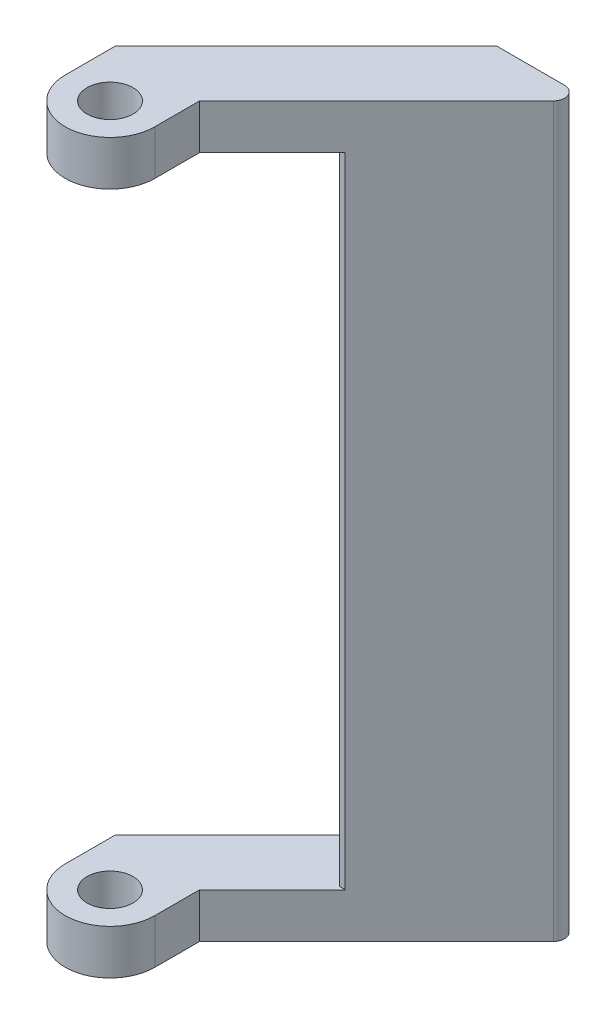
ISO-10303-21;
HEADER;
FILE_DESCRIPTION(('STEP AP214'),'2;1');
FILE_NAME('part.step','',(''),(''),'','','');
FILE_SCHEMA(('AUTOMOTIVE_DESIGN { 1 0 10303 214 1 1 1 1 }'));
ENDSEC;
DATA;
#1=APPLICATION_CONTEXT('core data for automotive mechanical design processes');
#2=APPLICATION_PROTOCOL_DEFINITION('international standard','automotive_design',2000,#1);
#3=PRODUCT_CONTEXT('',#1,'mechanical');
#4=PRODUCT('Part','Part','',(#3));
#5=PRODUCT_RELATED_PRODUCT_CATEGORY('part','',(#4));
#6=PRODUCT_DEFINITION_FORMATION('','',#4);
#7=PRODUCT_DEFINITION_CONTEXT('part definition',#1,'design');
#8=PRODUCT_DEFINITION('design','',#6,#7);
#9=PRODUCT_DEFINITION_SHAPE('','',#8);
#10=(LENGTH_UNIT() NAMED_UNIT(*) SI_UNIT(.MILLI.,.METRE.));
#11=(NAMED_UNIT(*) PLANE_ANGLE_UNIT() SI_UNIT($,.RADIAN.));
#12=(NAMED_UNIT(*) SI_UNIT($,.STERADIAN.) SOLID_ANGLE_UNIT());
#13=UNCERTAINTY_MEASURE_WITH_UNIT(LENGTH_MEASURE(1.E-05),#10,'distance_accuracy_value','');
#14=(GEOMETRIC_REPRESENTATION_CONTEXT(3) GLOBAL_UNCERTAINTY_ASSIGNED_CONTEXT((#13)) GLOBAL_UNIT_ASSIGNED_CONTEXT((#10,
#11,#12)) REPRESENTATION_CONTEXT('',''));
#15=CARTESIAN_POINT('',(0.,0.,0.));
#16=DIRECTION('',(0.,0.,1.));
#17=DIRECTION('',(1.,0.,0.));
#18=AXIS2_PLACEMENT_3D('',#15,#16,#17);
#19=CARTESIAN_POINT('',(-2.41421356205465,-57.59999997,0.999999999868094));
#20=DIRECTION('',(0.,-1.,0.));
#21=DIRECTION('',(0.,0.,-1.));
#22=AXIS2_PLACEMENT_3D('',#19,#20,#21);
#23=PLANE('',#22);
#24=CARTESIAN_POINT('',(-21.5,-57.59999997,21.5));
#25=DIRECTION('',(0.,-1.,0.));
#26=DIRECTION('',(0.,0.,-1.));
#27=AXIS2_PLACEMENT_3D('',#24,#25,#26);
#28=CIRCLE('',#27,2.04999999999999);
#29=CARTESIAN_POINT('',(-21.5,-57.59999997,19.45));
#30=VERTEX_POINT('',#29);
#31=EDGE_CURVE('E227',#30,#30,#28,.T.);
#32=ORIENTED_EDGE('',*,*,#31,.T.);
#33=EDGE_LOOP('',(#32));
#34=FACE_BOUND('',#33,.T.);
#35=DIRECTION('',(1.,0.,0.));
#36=VECTOR('',#35,1.);
#37=CARTESIAN_POINT('',(-11.0000000026681,-57.59999997,11.0000000026681));
#38=LINE('',#37,#36);
#39=CARTESIAN_POINT('',(-11.5000000024369,-57.59999997,11.0000000026681));
#40=VERTEX_POINT('',#39);
#41=CARTESIAN_POINT('',(-11.0000000026681,-57.59999997,11.0000000026681));
#42=VERTEX_POINT('',#41);
#43=EDGE_CURVE('E165',#40,#42,#38,.T.);
#44=ORIENTED_EDGE('',*,*,#43,.F.);
#45=DIRECTION('',(0.,0.,1.));
#46=VECTOR('',#45,1.);
#47=CARTESIAN_POINT('',(-11.5000000024369,-57.59999997,11.0000000026681));
#48=LINE('',#47,#46);
#49=CARTESIAN_POINT('',(-11.5000000024369,-57.59999997,3.01471862843689));
#50=VERTEX_POINT('',#49);
#51=EDGE_CURVE('E53',#50,#40,#48,.T.);
#52=ORIENTED_EDGE('',*,*,#51,.F.);
#53=DIRECTION('',(0.707106781186547,0.,-0.707106781186547));
#54=VECTOR('',#53,1.);
#55=CARTESIAN_POINT('',(-25.5,-57.59999997,17.014718626));
#56=LINE('',#55,#54);
#57=CARTESIAN_POINT('',(-25.5,-57.59999997,17.014718626));
#58=VERTEX_POINT('',#57);
#59=EDGE_CURVE('E288',#58,#50,#56,.T.);
#60=ORIENTED_EDGE('',*,*,#59,.F.);
#61=DIRECTION('',(0.,0.,-1.));
#62=VECTOR('',#61,1.);
#63=CARTESIAN_POINT('',(-25.5,-57.59999997,21.5));
#64=LINE('',#63,#62);
#65=CARTESIAN_POINT('',(-25.5,-57.59999997,21.5));
#66=VERTEX_POINT('',#65);
#67=EDGE_CURVE('E273',#66,#58,#64,.T.);
#68=ORIENTED_EDGE('',*,*,#67,.F.);
#69=CARTESIAN_POINT('',(-21.5,-57.59999997,21.5));
#70=DIRECTION('',(0.,-1.,0.));
#71=DIRECTION('',(0.,0.,-1.));
#72=AXIS2_PLACEMENT_3D('',#69,#70,#71);
#73=CIRCLE('',#72,4.);
#74=CARTESIAN_POINT('',(-17.5,-57.59999997,21.5));
#75=VERTEX_POINT('',#74);
#76=EDGE_CURVE('E261',#75,#66,#73,.T.);
#77=ORIENTED_EDGE('',*,*,#76,.F.);
#78=DIRECTION('',(0.,0.,1.));
#79=VECTOR('',#78,1.);
#80=CARTESIAN_POINT('',(-17.5,-57.59999997,17.5));
#81=LINE('',#80,#79);
#82=CARTESIAN_POINT('',(-17.5,-57.59999997,17.5));
#83=VERTEX_POINT('',#82);
#84=EDGE_CURVE('E287',#83,#75,#81,.T.);
#85=ORIENTED_EDGE('',*,*,#84,.F.);
#86=DIRECTION('',(-0.707106781186547,0.,0.707106781186548));
#87=VECTOR('',#86,1.);
#88=CARTESIAN_POINT('',(-1.70710678096137,-57.59999997,1.70710678096137));
#89=LINE('',#88,#87);
#90=EDGE_CURVE('E59',#42,#83,#89,.T.);
#91=ORIENTED_EDGE('',*,*,#90,.F.);
#92=EDGE_LOOP('',(#44,#52,#60,#68,#77,#85,#91));
#93=FACE_BOUND('',#92,.T.);
#94=ADVANCED_FACE('F36',(#34,#93),#23,.F.);
#95=CARTESIAN_POINT('',(-25.5,-57.59999997,21.5));
#96=DIRECTION('',(-1.,0.,0.));
#97=DIRECTION('',(0.,0.,1.));
#98=AXIS2_PLACEMENT_3D('',#95,#96,#97);
#99=PLANE('',#98);
#100=DIRECTION('',(0.,0.,-1.));
#101=VECTOR('',#100,1.);
#102=CARTESIAN_POINT('',(-25.5,-61.6,21.5));
#103=LINE('',#102,#101);
#104=CARTESIAN_POINT('',(-25.5,-61.6,21.5));
#105=VERTEX_POINT('',#104);
#106=CARTESIAN_POINT('',(-25.5,-61.6,17.014718626));
#107=VERTEX_POINT('',#106);
#108=EDGE_CURVE('E246',#105,#107,#103,.T.);
#109=ORIENTED_EDGE('',*,*,#108,.F.);
#110=DIRECTION('',(0.,-1.,0.));
#111=VECTOR('',#110,1.);
#112=CARTESIAN_POINT('',(-25.5,-57.59999997,21.5));
#113=LINE('',#112,#111);
#114=EDGE_CURVE('E11',#66,#105,#113,.T.);
#115=ORIENTED_EDGE('',*,*,#114,.F.);
#116=ORIENTED_EDGE('',*,*,#67,.T.);
#117=DIRECTION('',(0.,-1.,0.));
#118=VECTOR('',#117,1.);
#119=CARTESIAN_POINT('',(-25.5,-57.59999997,17.014718626));
#120=LINE('',#119,#118);
#121=EDGE_CURVE('E283',#58,#107,#120,.T.);
#122=ORIENTED_EDGE('',*,*,#121,.T.);
#123=EDGE_LOOP('',(#109,#115,#116,#122));
#124=FACE_BOUND('',#123,.T.);
#125=ADVANCED_FACE('F38',(#124),#99,.T.);
#126=CARTESIAN_POINT('',(-21.5,-57.59999997,21.5));
#127=DIRECTION('',(0.,-1.,0.));
#128=DIRECTION('',(0.,0.,-1.));
#129=AXIS2_PLACEMENT_3D('',#126,#127,#128);
#130=CYLINDRICAL_SURFACE('',#129,4.);
#131=CARTESIAN_POINT('',(-21.5,-61.6,21.5));
#132=DIRECTION('',(0.,-1.,0.));
#133=DIRECTION('',(0.,0.,-1.));
#134=AXIS2_PLACEMENT_3D('',#131,#132,#133);
#135=CIRCLE('',#134,4.);
#136=CARTESIAN_POINT('',(-17.5,-61.6,21.5));
#137=VERTEX_POINT('',#136);
#138=EDGE_CURVE('E251',#137,#105,#135,.T.);
#139=ORIENTED_EDGE('',*,*,#138,.F.);
#140=DIRECTION('',(0.,-1.,0.));
#141=VECTOR('',#140,1.);
#142=CARTESIAN_POINT('',(-17.5,-57.59999997,21.5));
#143=LINE('',#142,#141);
#144=EDGE_CURVE('E45',#75,#137,#143,.T.);
#145=ORIENTED_EDGE('',*,*,#144,.F.);
#146=ORIENTED_EDGE('',*,*,#76,.T.);
#147=ORIENTED_EDGE('',*,*,#114,.T.);
#148=EDGE_LOOP('',(#139,#145,#146,#147));
#149=FACE_BOUND('',#148,.T.);
#150=ADVANCED_FACE('F299',(#149),#130,.T.);
#151=CARTESIAN_POINT('',(-17.5,-57.59999997,17.5));
#152=DIRECTION('',(1.,0.,0.));
#153=DIRECTION('',(0.,0.,-1.));
#154=AXIS2_PLACEMENT_3D('',#151,#152,#153);
#155=PLANE('',#154);
#156=DIRECTION('',(0.,0.,1.));
#157=VECTOR('',#156,1.);
#158=CARTESIAN_POINT('',(-17.5,-61.6,17.5));
#159=LINE('',#158,#157);
#160=CARTESIAN_POINT('',(-17.5,-61.6,17.5));
#161=VERTEX_POINT('',#160);
#162=EDGE_CURVE('E271',#161,#137,#159,.T.);
#163=ORIENTED_EDGE('',*,*,#162,.F.);
#164=DIRECTION('',(0.,-1.,0.));
#165=VECTOR('',#164,1.);
#166=CARTESIAN_POINT('',(-17.5,-57.59999997,17.5));
#167=LINE('',#166,#165);
#168=EDGE_CURVE('E276',#83,#161,#167,.T.);
#169=ORIENTED_EDGE('',*,*,#168,.F.);
#170=ORIENTED_EDGE('',*,*,#84,.T.);
#171=ORIENTED_EDGE('',*,*,#144,.T.);
#172=EDGE_LOOP('',(#163,#169,#170,#171));
#173=FACE_BOUND('',#172,.T.);
#174=ADVANCED_FACE('F337',(#173),#155,.T.);
#175=CARTESIAN_POINT('',(-1.70710678096137,-57.59999997,1.70710678096137));
#176=DIRECTION('',(0.707106781186548,0.,0.707106781186547));
#177=DIRECTION('',(0.707106781186547,0.,-0.707106781186548));
#178=AXIS2_PLACEMENT_3D('',#175,#176,#177);
#179=PLANE('',#178);
#180=DIRECTION('',(-0.707106781186547,0.,0.707106781186548));
#181=VECTOR('',#180,1.);
#182=CARTESIAN_POINT('',(-1.70710678096137,-61.6,1.70710678096137));
#183=LINE('',#182,#181);
#184=CARTESIAN_POINT('',(-1.70710678096137,-61.6,1.70710678096137));
#185=VERTEX_POINT('',#184);
#186=EDGE_CURVE('E268',#185,#161,#183,.T.);
#187=ORIENTED_EDGE('',*,*,#186,.F.);
#188=DIRECTION('',(0.,-1.,0.));
#189=VECTOR('',#188,1.);
#190=CARTESIAN_POINT('',(-1.70710678096137,-57.59999997,1.70710678096137));
#191=LINE('',#190,#189);
#192=CARTESIAN_POINT('',(-1.707106781,3.39999999999999,1.707106781));
#193=VERTEX_POINT('',#192);
#194=EDGE_CURVE('E215',#193,#185,#191,.T.);
#195=ORIENTED_EDGE('',*,*,#194,.F.);
#196=DIRECTION('',(0.707106781186548,0.,-0.707106781186548));
#197=VECTOR('',#196,1.);
#198=CARTESIAN_POINT('',(-1.707106781,3.39999999999999,1.707106781));
#199=LINE('',#198,#197);
#200=CARTESIAN_POINT('',(-17.5000000009784,3.39999999999999,17.5000000009784));
#201=VERTEX_POINT('',#200);
#202=EDGE_CURVE('E214',#201,#193,#199,.T.);
#203=ORIENTED_EDGE('',*,*,#202,.F.);
#204=DIRECTION('',(0.,-1.,0.));
#205=VECTOR('',#204,1.);
#206=CARTESIAN_POINT('',(-17.5000000009784,3.39999999999999,17.5000000009784));
#207=LINE('',#206,#205);
#208=CARTESIAN_POINT('',(-17.5000000009784,-0.60000000000001,17.5000000009784));
#209=VERTEX_POINT('',#208);
#210=EDGE_CURVE('E187',#201,#209,#207,.T.);
#211=ORIENTED_EDGE('',*,*,#210,.T.);
#212=DIRECTION('',(0.707106781186548,0.,-0.707106781186548));
#213=VECTOR('',#212,1.);
#214=CARTESIAN_POINT('',(-1.707106781,-0.60000000000001,1.707106781));
#215=LINE('',#214,#213);
#216=CARTESIAN_POINT('',(-11.0000000026681,-0.60000000000001,11.0000000026681));
#217=VERTEX_POINT('',#216);
#218=EDGE_CURVE('E157',#209,#217,#215,.T.);
#219=ORIENTED_EDGE('',*,*,#218,.T.);
#220=DIRECTION('',(0.,-1.,0.));
#221=VECTOR('',#220,1.);
#222=CARTESIAN_POINT('',(-11.0000000026681,-0.60000000000001,11.0000000026681));
#223=LINE('',#222,#221);
#224=EDGE_CURVE('E211',#217,#42,#223,.T.);
#225=ORIENTED_EDGE('',*,*,#224,.T.);
#226=ORIENTED_EDGE('',*,*,#90,.T.);
#227=ORIENTED_EDGE('',*,*,#168,.T.);
#228=EDGE_LOOP('',(#187,#195,#203,#211,#219,#225,#226,#227));
#229=FACE_BOUND('',#228,.T.);
#230=ADVANCED_FACE('F210',(#229),#179,.T.);
#231=CARTESIAN_POINT('',(-2.41421356205465,-57.59999997,0.999999999868094));
#232=DIRECTION('',(0.,-1.,0.));
#233=DIRECTION('',(0.,0.,-1.));
#234=AXIS2_PLACEMENT_3D('',#231,#232,#233);
#235=CYLINDRICAL_SURFACE('',#234,0.999999999868096);
#236=CARTESIAN_POINT('',(-2.41421356205465,-61.6,0.999999999868094));
#237=DIRECTION('',(0.,-1.,0.));
#238=DIRECTION('',(0.,0.,-1.));
#239=AXIS2_PLACEMENT_3D('',#236,#237,#238);
#240=CIRCLE('',#239,0.999999999868096);
#241=CARTESIAN_POINT('',(-2.41421356205465,-61.6,0.));
#242=VERTEX_POINT('',#241);
#243=EDGE_CURVE('E265',#242,#185,#240,.T.);
#244=ORIENTED_EDGE('',*,*,#243,.F.);
#245=DIRECTION('',(0.,-1.,0.));
#246=VECTOR('',#245,1.);
#247=CARTESIAN_POINT('',(-2.41421356205465,-57.59999997,0.));
#248=LINE('',#247,#246);
#249=CARTESIAN_POINT('',(-2.41421356209327,3.39999999999999,3.86348938952175E-11));
#250=VERTEX_POINT('',#249);
#251=EDGE_CURVE('E279',#250,#242,#248,.T.);
#252=ORIENTED_EDGE('',*,*,#251,.F.);
#253=CARTESIAN_POINT('',(-2.41421356209327,3.39999999999999,0.999999999906726));
#254=DIRECTION('',(0.,1.,0.));
#255=DIRECTION('',(0.,0.,-1.));
#256=AXIS2_PLACEMENT_3D('',#253,#254,#255);
#257=CIRCLE('',#256,0.999999999868091);
#258=EDGE_CURVE('E217',#193,#250,#257,.T.);
#259=ORIENTED_EDGE('',*,*,#258,.F.);
#260=ORIENTED_EDGE('',*,*,#194,.T.);
#261=EDGE_LOOP('',(#244,#252,#259,#260));
#262=FACE_BOUND('',#261,.T.);
#263=ADVANCED_FACE('F342',(#262),#235,.T.);
#264=CARTESIAN_POINT('',(-8.485281374,-57.59999997,0.));
#265=DIRECTION('',(0.,0.,-1.));
#266=DIRECTION('',(-1.,0.,0.));
#267=AXIS2_PLACEMENT_3D('',#264,#265,#266);
#268=PLANE('',#267);
#269=DIRECTION('',(1.,0.,0.));
#270=VECTOR('',#269,1.);
#271=CARTESIAN_POINT('',(-8.485281374,-61.6,0.));
#272=LINE('',#271,#270);
#273=CARTESIAN_POINT('',(-8.485281374,-61.6,0.));
#274=VERTEX_POINT('',#273);
#275=EDGE_CURVE('E255',#274,#242,#272,.T.);
#276=ORIENTED_EDGE('',*,*,#275,.F.);
#277=DIRECTION('',(0.,-1.,0.));
#278=VECTOR('',#277,1.);
#279=CARTESIAN_POINT('',(-8.485281374,-57.59999997,0.));
#280=LINE('',#279,#278);
#281=CARTESIAN_POINT('',(-8.48528137409328,3.39999999999999,3.86356318444721E-11));
#282=VERTEX_POINT('',#281);
#283=EDGE_CURVE('E281',#282,#274,#280,.T.);
#284=ORIENTED_EDGE('',*,*,#283,.F.);
#285=DIRECTION('',(-1.,0.,0.));
#286=VECTOR('',#285,1.);
#287=CARTESIAN_POINT('',(-8.48528137409328,3.39999999999999,3.86356318444721E-11));
#288=LINE('',#287,#286);
#289=EDGE_CURVE('E155',#250,#282,#288,.T.);
#290=ORIENTED_EDGE('',*,*,#289,.F.);
#291=ORIENTED_EDGE('',*,*,#251,.T.);
#292=EDGE_LOOP('',(#276,#284,#290,#291));
#293=FACE_BOUND('',#292,.T.);
#294=ADVANCED_FACE('F345',(#293),#268,.T.);
#295=CARTESIAN_POINT('',(-25.5,-57.59999997,17.014718626));
#296=DIRECTION('',(-0.707106781186548,0.,-0.707106781186548));
#297=DIRECTION('',(-0.707106781186547,0.,0.707106781186548));
#298=AXIS2_PLACEMENT_3D('',#295,#296,#297);
#299=PLANE('',#298);
#300=DIRECTION('',(0.707106781186547,0.,-0.707106781186547));
#301=VECTOR('',#300,1.);
#302=CARTESIAN_POINT('',(-25.5,-61.6,17.014718626));
#303=LINE('',#302,#301);
#304=EDGE_CURVE('E248',#107,#274,#303,.T.);
#305=ORIENTED_EDGE('',*,*,#304,.F.);
#306=ORIENTED_EDGE('',*,*,#121,.F.);
#307=ORIENTED_EDGE('',*,*,#59,.T.);
#308=DIRECTION('',(0.,-1.,0.));
#309=VECTOR('',#308,1.);
#310=CARTESIAN_POINT('',(-11.5000000024369,-0.60000000000001,3.01471862838225));
#311=LINE('',#310,#309);
#312=CARTESIAN_POINT('',(-11.5000000024369,-0.60000000000001,3.01471862838225));
#313=VERTEX_POINT('',#312);
#314=EDGE_CURVE('E253',#313,#50,#311,.T.);
#315=ORIENTED_EDGE('',*,*,#314,.F.);
#316=DIRECTION('',(-0.707106781186548,0.,0.707106781186548));
#317=VECTOR('',#316,1.);
#318=CARTESIAN_POINT('',(-25.5000000000933,-0.60000000000001,17.0147186260386));
#319=LINE('',#318,#317);
#320=CARTESIAN_POINT('',(-25.5000000000933,-0.60000000000001,17.0147186260386));
#321=VERTEX_POINT('',#320);
#322=EDGE_CURVE('E162',#313,#321,#319,.T.);
#323=ORIENTED_EDGE('',*,*,#322,.T.);
#324=DIRECTION('',(0.,-1.,0.));
#325=VECTOR('',#324,1.);
#326=CARTESIAN_POINT('',(-25.5000000000933,3.39999999999999,17.0147186260386));
#327=LINE('',#326,#325);
#328=CARTESIAN_POINT('',(-25.5000000000933,3.39999999999999,17.0147186260386));
#329=VERTEX_POINT('',#328);
#330=EDGE_CURVE('E142',#329,#321,#327,.T.);
#331=ORIENTED_EDGE('',*,*,#330,.F.);
#332=DIRECTION('',(-0.707106781186548,0.,0.707106781186548));
#333=VECTOR('',#332,1.);
#334=CARTESIAN_POINT('',(-25.5000000000933,3.39999999999999,17.0147186260386));
#335=LINE('',#334,#333);
#336=EDGE_CURVE('E148',#282,#329,#335,.T.);
#337=ORIENTED_EDGE('',*,*,#336,.F.);
#338=ORIENTED_EDGE('',*,*,#283,.T.);
#339=EDGE_LOOP('',(#305,#306,#307,#315,#323,#331,#337,#338));
#340=FACE_BOUND('',#339,.T.);
#341=ADVANCED_FACE('F160',(#340),#299,.T.);
#342=CARTESIAN_POINT('',(-2.41421356205465,-61.6,0.999999999868094));
#343=DIRECTION('',(0.,-1.,0.));
#344=DIRECTION('',(0.,0.,-1.));
#345=AXIS2_PLACEMENT_3D('',#342,#343,#344);
#346=PLANE('',#345);
#347=CARTESIAN_POINT('',(-21.5,-61.6,21.5));
#348=DIRECTION('',(0.,-1.,0.));
#349=DIRECTION('',(0.,0.,-1.));
#350=AXIS2_PLACEMENT_3D('',#347,#348,#349);
#351=CIRCLE('',#350,2.04999999999999);
#352=CARTESIAN_POINT('',(-21.5,-61.6,19.45));
#353=VERTEX_POINT('',#352);
#354=EDGE_CURVE('E230',#353,#353,#351,.T.);
#355=ORIENTED_EDGE('',*,*,#354,.F.);
#356=EDGE_LOOP('',(#355));
#357=FACE_BOUND('',#356,.T.);
#358=ORIENTED_EDGE('',*,*,#108,.T.);
#359=ORIENTED_EDGE('',*,*,#304,.T.);
#360=ORIENTED_EDGE('',*,*,#275,.T.);
#361=ORIENTED_EDGE('',*,*,#243,.T.);
#362=ORIENTED_EDGE('',*,*,#186,.T.);
#363=ORIENTED_EDGE('',*,*,#162,.T.);
#364=ORIENTED_EDGE('',*,*,#138,.T.);
#365=EDGE_LOOP('',(#358,#359,#360,#361,#362,#363,#364));
#366=FACE_BOUND('',#365,.T.);
#367=ADVANCED_FACE('F237',(#357,#366),#346,.T.);
#368=CARTESIAN_POINT('',(-11.5000000024369,-0.60000000000001,11.0000000026681));
#369=DIRECTION('',(1.,0.,0.));
#370=DIRECTION('',(0.,0.,-1.));
#371=AXIS2_PLACEMENT_3D('',#368,#369,#370);
#372=PLANE('',#371);
#373=ORIENTED_EDGE('',*,*,#51,.T.);
#374=DIRECTION('',(0.,-1.,0.));
#375=VECTOR('',#374,1.);
#376=CARTESIAN_POINT('',(-11.5000000024369,-0.60000000000001,11.0000000026681));
#377=LINE('',#376,#375);
#378=CARTESIAN_POINT('',(-11.5000000024369,-0.60000000000001,11.0000000026681));
#379=VERTEX_POINT('',#378);
#380=EDGE_CURVE('E258',#379,#40,#377,.T.);
#381=ORIENTED_EDGE('',*,*,#380,.F.);
#382=DIRECTION('',(0.,0.,1.));
#383=VECTOR('',#382,1.);
#384=CARTESIAN_POINT('',(-11.5000000024369,-0.60000000000001,11.0000000026681));
#385=LINE('',#384,#383);
#386=EDGE_CURVE('E310',#313,#379,#385,.T.);
#387=ORIENTED_EDGE('',*,*,#386,.F.);
#388=ORIENTED_EDGE('',*,*,#314,.T.);
#389=EDGE_LOOP('',(#373,#381,#387,#388));
#390=FACE_BOUND('',#389,.T.);
#391=ADVANCED_FACE('F240',(#390),#372,.F.);
#392=CARTESIAN_POINT('',(-11.0000000026681,-0.60000000000001,11.0000000026681));
#393=DIRECTION('',(0.,0.,-1.));
#394=DIRECTION('',(-1.,0.,0.));
#395=AXIS2_PLACEMENT_3D('',#392,#393,#394);
#396=PLANE('',#395);
#397=ORIENTED_EDGE('',*,*,#43,.T.);
#398=ORIENTED_EDGE('',*,*,#224,.F.);
#399=DIRECTION('',(1.,0.,0.));
#400=VECTOR('',#399,1.);
#401=CARTESIAN_POINT('',(-11.0000000026681,-0.60000000000001,11.0000000026681));
#402=LINE('',#401,#400);
#403=EDGE_CURVE('E206',#379,#217,#402,.T.);
#404=ORIENTED_EDGE('',*,*,#403,.F.);
#405=ORIENTED_EDGE('',*,*,#380,.T.);
#406=EDGE_LOOP('',(#397,#398,#404,#405));
#407=FACE_BOUND('',#406,.T.);
#408=ADVANCED_FACE('F318',(#407),#396,.F.);
#409=CARTESIAN_POINT('',(-25.5000000000933,3.39999999999999,21.5000000000386));
#410=DIRECTION('',(1.,0.,0.));
#411=DIRECTION('',(0.,0.,-1.));
#412=AXIS2_PLACEMENT_3D('',#409,#410,#411);
#413=PLANE('',#412);
#414=DIRECTION('',(0.,0.,1.));
#415=VECTOR('',#414,1.);
#416=CARTESIAN_POINT('',(-25.5000000000933,-0.60000000000001,21.5000000000386));
#417=LINE('',#416,#415);
#418=CARTESIAN_POINT('',(-25.5000000000933,-0.60000000000001,21.5000000000386));
#419=VERTEX_POINT('',#418);
#420=EDGE_CURVE('E173',#321,#419,#417,.T.);
#421=ORIENTED_EDGE('',*,*,#420,.T.);
#422=DIRECTION('',(0.,-1.,0.));
#423=VECTOR('',#422,1.);
#424=CARTESIAN_POINT('',(-25.5000000000933,3.39999999999999,21.5000000000386));
#425=LINE('',#424,#423);
#426=CARTESIAN_POINT('',(-25.5000000000933,3.39999999999999,21.5000000000386));
#427=VERTEX_POINT('',#426);
#428=EDGE_CURVE('E144',#427,#419,#425,.T.);
#429=ORIENTED_EDGE('',*,*,#428,.F.);
#430=DIRECTION('',(0.,0.,1.));
#431=VECTOR('',#430,1.);
#432=CARTESIAN_POINT('',(-25.5000000000933,3.39999999999999,21.5000000000386));
#433=LINE('',#432,#431);
#434=EDGE_CURVE('E138',#329,#427,#433,.T.);
#435=ORIENTED_EDGE('',*,*,#434,.F.);
#436=ORIENTED_EDGE('',*,*,#330,.T.);
#437=EDGE_LOOP('',(#421,#429,#435,#436));
#438=FACE_BOUND('',#437,.T.);
#439=ADVANCED_FACE('F140',(#438),#413,.F.);
#440=CARTESIAN_POINT('',(-21.5000000005358,3.39999999999999,21.5000000000386));
#441=DIRECTION('',(0.,-1.,0.));
#442=DIRECTION('',(0.,0.,-1.));
#443=AXIS2_PLACEMENT_3D('',#440,#441,#442);
#444=CYLINDRICAL_SURFACE('',#443,3.99999999955746);
#445=CARTESIAN_POINT('',(-21.5000000005358,-0.60000000000001,21.5000000000386));
#446=DIRECTION('',(0.,1.,0.));
#447=DIRECTION('',(0.,0.,-1.));
#448=AXIS2_PLACEMENT_3D('',#445,#446,#447);
#449=CIRCLE('',#448,3.99999999955746);
#450=CARTESIAN_POINT('',(-17.5000000009784,-0.60000000000001,21.5000000000386));
#451=VERTEX_POINT('',#450);
#452=EDGE_CURVE('E182',#419,#451,#449,.T.);
#453=ORIENTED_EDGE('',*,*,#452,.T.);
#454=DIRECTION('',(0.,-1.,0.));
#455=VECTOR('',#454,1.);
#456=CARTESIAN_POINT('',(-17.5000000009784,3.39999999999999,21.5000000000386));
#457=LINE('',#456,#455);
#458=CARTESIAN_POINT('',(-17.5000000009784,3.39999999999999,21.5000000000386));
#459=VERTEX_POINT('',#458);
#460=EDGE_CURVE('E167',#459,#451,#457,.T.);
#461=ORIENTED_EDGE('',*,*,#460,.F.);
#462=CARTESIAN_POINT('',(-21.5000000005358,3.39999999999999,21.5000000000386));
#463=DIRECTION('',(0.,1.,0.));
#464=DIRECTION('',(0.,0.,-1.));
#465=AXIS2_PLACEMENT_3D('',#462,#463,#464);
#466=CIRCLE('',#465,3.99999999955746);
#467=EDGE_CURVE('E147',#427,#459,#466,.T.);
#468=ORIENTED_EDGE('',*,*,#467,.F.);
#469=ORIENTED_EDGE('',*,*,#428,.T.);
#470=EDGE_LOOP('',(#453,#461,#468,#469));
#471=FACE_BOUND('',#470,.T.);
#472=ADVANCED_FACE('F325',(#471),#444,.T.);
#473=CARTESIAN_POINT('',(-17.5000000009784,3.39999999999999,17.5000000009784));
#474=DIRECTION('',(-1.,0.,0.));
#475=DIRECTION('',(0.,0.,1.));
#476=AXIS2_PLACEMENT_3D('',#473,#474,#475);
#477=PLANE('',#476);
#478=DIRECTION('',(0.,0.,-1.));
#479=VECTOR('',#478,1.);
#480=CARTESIAN_POINT('',(-17.5000000009784,-0.60000000000001,17.5000000009784));
#481=LINE('',#480,#479);
#482=EDGE_CURVE('E184',#451,#209,#481,.T.);
#483=ORIENTED_EDGE('',*,*,#482,.T.);
#484=ORIENTED_EDGE('',*,*,#210,.F.);
#485=DIRECTION('',(0.,0.,-1.));
#486=VECTOR('',#485,1.);
#487=CARTESIAN_POINT('',(-17.5000000009784,3.39999999999999,17.5000000009784));
#488=LINE('',#487,#486);
#489=EDGE_CURVE('E196',#459,#201,#488,.T.);
#490=ORIENTED_EDGE('',*,*,#489,.F.);
#491=ORIENTED_EDGE('',*,*,#460,.T.);
#492=EDGE_LOOP('',(#483,#484,#490,#491));
#493=FACE_BOUND('',#492,.T.);
#494=ADVANCED_FACE('F194',(#493),#477,.F.);
#495=CARTESIAN_POINT('',(-2.41421356209327,3.39999999999999,0.999999999906726));
#496=DIRECTION('',(0.,-1.,0.));
#497=DIRECTION('',(0.,0.,-1.));
#498=AXIS2_PLACEMENT_3D('',#495,#496,#497);
#499=PLANE('',#498);
#500=CARTESIAN_POINT('',(-21.5,3.39999999999999,21.5));
#501=DIRECTION('',(0.,1.,0.));
#502=DIRECTION('',(0.,0.,1.));
#503=AXIS2_PLACEMENT_3D('',#500,#501,#502);
#504=CIRCLE('',#503,2.04999999999999);
#505=CARTESIAN_POINT('',(-21.5,3.39999999999999,23.55));
#506=VERTEX_POINT('',#505);
#507=EDGE_CURVE('E224',#506,#506,#504,.T.);
#508=ORIENTED_EDGE('',*,*,#507,.F.);
#509=EDGE_LOOP('',(#508));
#510=FACE_BOUND('',#509,.T.);
#511=ORIENTED_EDGE('',*,*,#336,.T.);
#512=ORIENTED_EDGE('',*,*,#434,.T.);
#513=ORIENTED_EDGE('',*,*,#467,.T.);
#514=ORIENTED_EDGE('',*,*,#489,.T.);
#515=ORIENTED_EDGE('',*,*,#202,.T.);
#516=ORIENTED_EDGE('',*,*,#258,.T.);
#517=ORIENTED_EDGE('',*,*,#289,.T.);
#518=EDGE_LOOP('',(#511,#512,#513,#514,#515,#516,#517));
#519=FACE_BOUND('',#518,.T.);
#520=ADVANCED_FACE('F152',(#510,#519),#499,.F.);
#521=CARTESIAN_POINT('',(-2.41421356209327,-0.60000000000001,0.999999999906726));
#522=DIRECTION('',(0.,-1.,0.));
#523=DIRECTION('',(0.,0.,-1.));
#524=AXIS2_PLACEMENT_3D('',#521,#522,#523);
#525=PLANE('',#524);
#526=CARTESIAN_POINT('',(-21.5,-0.60000000000001,21.5));
#527=DIRECTION('',(0.,-1.,0.));
#528=DIRECTION('',(0.,0.,-1.));
#529=AXIS2_PLACEMENT_3D('',#526,#527,#528);
#530=CIRCLE('',#529,2.05);
#531=CARTESIAN_POINT('',(-21.5,-0.60000000000001,19.45));
#532=VERTEX_POINT('',#531);
#533=EDGE_CURVE('E174',#532,#532,#530,.T.);
#534=ORIENTED_EDGE('',*,*,#533,.F.);
#535=EDGE_LOOP('',(#534));
#536=FACE_BOUND('',#535,.T.);
#537=ORIENTED_EDGE('',*,*,#322,.F.);
#538=ORIENTED_EDGE('',*,*,#386,.T.);
#539=ORIENTED_EDGE('',*,*,#403,.T.);
#540=ORIENTED_EDGE('',*,*,#218,.F.);
#541=ORIENTED_EDGE('',*,*,#482,.F.);
#542=ORIENTED_EDGE('',*,*,#452,.F.);
#543=ORIENTED_EDGE('',*,*,#420,.F.);
#544=EDGE_LOOP('',(#537,#538,#539,#540,#541,#542,#543));
#545=FACE_BOUND('',#544,.T.);
#546=ADVANCED_FACE('F201',(#536,#545),#525,.T.);
#547=CARTESIAN_POINT('',(-21.5,3.39999999999999,21.5));
#548=DIRECTION('',(0.,1.,0.));
#549=DIRECTION('',(0.,0.,1.));
#550=AXIS2_PLACEMENT_3D('',#547,#548,#549);
#551=CYLINDRICAL_SURFACE('',#550,2.05);
#552=ORIENTED_EDGE('',*,*,#507,.T.);
#553=EDGE_LOOP('',(#552));
#554=FACE_BOUND('',#553,.T.);
#555=ORIENTED_EDGE('',*,*,#533,.T.);
#556=EDGE_LOOP('',(#555));
#557=FACE_BOUND('',#556,.T.);
#558=ADVANCED_FACE('F409',(#554,#557),#551,.F.);
#559=CARTESIAN_POINT('',(-21.5,-61.6,21.5));
#560=DIRECTION('',(0.,-1.,0.));
#561=DIRECTION('',(0.,0.,-1.));
#562=AXIS2_PLACEMENT_3D('',#559,#560,#561);
#563=CYLINDRICAL_SURFACE('',#562,2.04999999999999);
#564=ORIENTED_EDGE('',*,*,#354,.T.);
#565=EDGE_LOOP('',(#564));
#566=FACE_BOUND('',#565,.T.);
#567=ORIENTED_EDGE('',*,*,#31,.F.);
#568=EDGE_LOOP('',(#567));
#569=FACE_BOUND('',#568,.T.);
#570=ADVANCED_FACE('F234',(#566,#569),#563,.F.);
#571=CLOSED_SHELL('',(#94,#125,#150,#174,#230,#263,#294,#341,#367,#391,#408,#439,#472,#494,#520,
#546,#558,#570));
#572=MANIFOLD_SOLID_BREP('B2',#571);
#573=ADVANCED_BREP_SHAPE_REPRESENTATION('',(#18,#572),#14);
#574=SHAPE_DEFINITION_REPRESENTATION(#9,#573);
ENDSEC;
END-ISO-10303-21;
